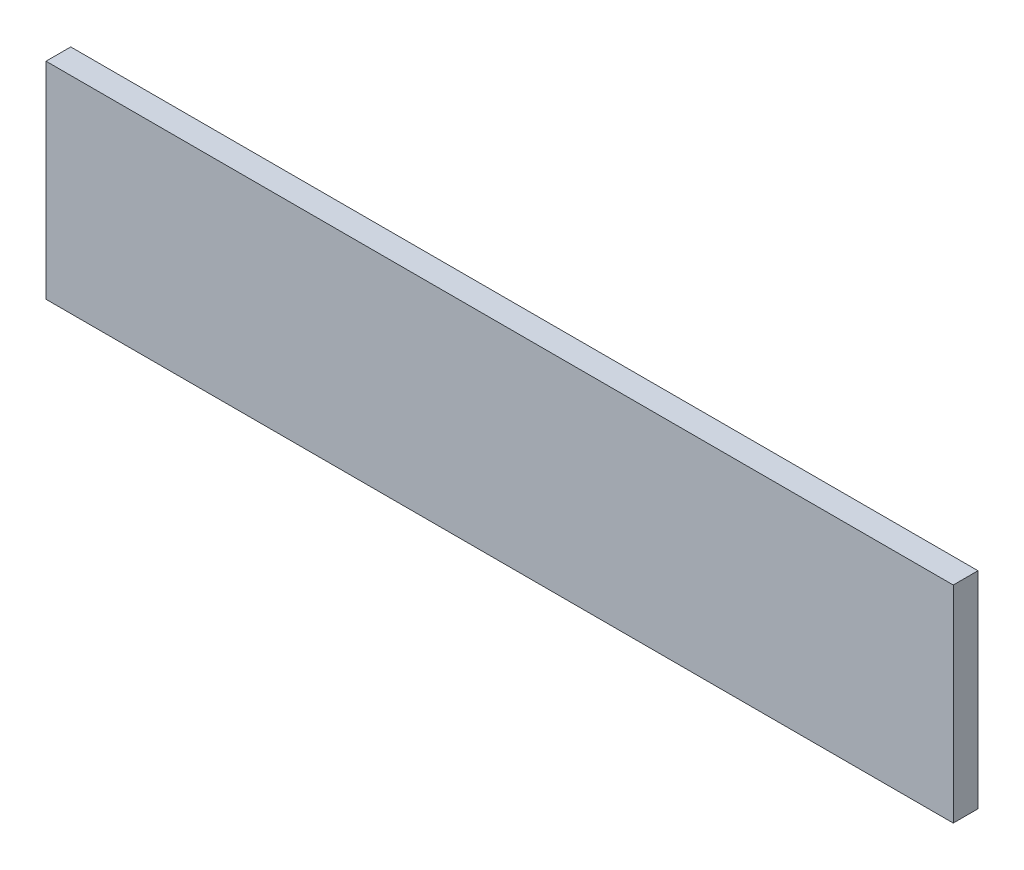
ISO-10303-21;
HEADER;
FILE_DESCRIPTION(('STEP AP214'),'2;1');
FILE_NAME('part.step','',(''),(''),'','','');
FILE_SCHEMA(('AUTOMOTIVE_DESIGN { 1 0 10303 214 1 1 1 1 }'));
ENDSEC;
DATA;
#1=APPLICATION_CONTEXT('core data for automotive mechanical design processes');
#2=APPLICATION_PROTOCOL_DEFINITION('international standard','automotive_design',2000,#1);
#3=PRODUCT_CONTEXT('',#1,'mechanical');
#4=PRODUCT('Part','Part','',(#3));
#5=PRODUCT_RELATED_PRODUCT_CATEGORY('part','',(#4));
#6=PRODUCT_DEFINITION_FORMATION('','',#4);
#7=PRODUCT_DEFINITION_CONTEXT('part definition',#1,'design');
#8=PRODUCT_DEFINITION('design','',#6,#7);
#9=PRODUCT_DEFINITION_SHAPE('','',#8);
#10=(LENGTH_UNIT() NAMED_UNIT(*) SI_UNIT(.MILLI.,.METRE.));
#11=(NAMED_UNIT(*) PLANE_ANGLE_UNIT() SI_UNIT($,.RADIAN.));
#12=(NAMED_UNIT(*) SI_UNIT($,.STERADIAN.) SOLID_ANGLE_UNIT());
#13=UNCERTAINTY_MEASURE_WITH_UNIT(LENGTH_MEASURE(1.E-05),#10,'distance_accuracy_value','');
#14=(GEOMETRIC_REPRESENTATION_CONTEXT(3) GLOBAL_UNCERTAINTY_ASSIGNED_CONTEXT((#13)) GLOBAL_UNIT_ASSIGNED_CONTEXT((#10,
#11,#12)) REPRESENTATION_CONTEXT('',''));
#15=CARTESIAN_POINT('',(0.,0.,0.));
#16=DIRECTION('',(0.,0.,1.));
#17=DIRECTION('',(1.,0.,0.));
#18=AXIS2_PLACEMENT_3D('',#15,#16,#17);
#19=CARTESIAN_POINT('',(0.,0.,0.));
#20=DIRECTION('',(0.,0.,1.));
#21=DIRECTION('',(1.,0.,0.));
#22=AXIS2_PLACEMENT_3D('',#19,#20,#21);
#23=PLANE('',#22);
#24=DIRECTION('',(0.,1.,0.));
#25=VECTOR('',#24,1.);
#26=CARTESIAN_POINT('',(550.,125.,0.));
#27=LINE('',#26,#25);
#28=CARTESIAN_POINT('',(550.,-125.,0.));
#29=VERTEX_POINT('',#28);
#30=CARTESIAN_POINT('',(550.,125.,0.));
#31=VERTEX_POINT('',#30);
#32=EDGE_CURVE('E20',#29,#31,#27,.T.);
#33=ORIENTED_EDGE('',*,*,#32,.F.);
#34=DIRECTION('',(1.,0.,0.));
#35=VECTOR('',#34,1.);
#36=CARTESIAN_POINT('',(550.,-125.,0.));
#37=LINE('',#36,#35);
#38=CARTESIAN_POINT('',(-550.,-125.,0.));
#39=VERTEX_POINT('',#38);
#40=EDGE_CURVE('E80',#39,#29,#37,.T.);
#41=ORIENTED_EDGE('',*,*,#40,.F.);
#42=DIRECTION('',(0.,1.,0.));
#43=VECTOR('',#42,1.);
#44=CARTESIAN_POINT('',(-550.,-125.,0.));
#45=LINE('',#44,#43);
#46=CARTESIAN_POINT('',(-550.,125.,0.));
#47=VERTEX_POINT('',#46);
#48=EDGE_CURVE('E68',#47,#39,#45,.F.);
#49=ORIENTED_EDGE('',*,*,#48,.F.);
#50=DIRECTION('',(1.,0.,0.));
#51=VECTOR('',#50,1.);
#52=CARTESIAN_POINT('',(-550.,125.,0.));
#53=LINE('',#52,#51);
#54=EDGE_CURVE('E55',#31,#47,#53,.F.);
#55=ORIENTED_EDGE('',*,*,#54,.F.);
#56=EDGE_LOOP('',(#33,#41,#49,#55));
#57=FACE_BOUND('',#56,.T.);
#58=ADVANCED_FACE('F17',(#57),#23,.F.);
#59=CARTESIAN_POINT('',(550.,125.,0.));
#60=DIRECTION('',(1.,0.,0.));
#61=DIRECTION('',(0.,0.,-1.));
#62=AXIS2_PLACEMENT_3D('',#59,#60,#61);
#63=PLANE('',#62);
#64=ORIENTED_EDGE('',*,*,#32,.T.);
#65=DIRECTION('',(0.,0.,1.));
#66=VECTOR('',#65,1.);
#67=CARTESIAN_POINT('',(550.,125.,0.));
#68=LINE('',#67,#66);
#69=CARTESIAN_POINT('',(550.,125.,30.));
#70=VERTEX_POINT('',#69);
#71=EDGE_CURVE('E61',#70,#31,#68,.F.);
#72=ORIENTED_EDGE('',*,*,#71,.F.);
#73=DIRECTION('',(0.,1.,0.));
#74=VECTOR('',#73,1.);
#75=CARTESIAN_POINT('',(550.,0.,30.));
#76=LINE('',#75,#74);
#77=CARTESIAN_POINT('',(550.,-125.,30.));
#78=VERTEX_POINT('',#77);
#79=EDGE_CURVE('E83',#78,#70,#76,.T.);
#80=ORIENTED_EDGE('',*,*,#79,.F.);
#81=DIRECTION('',(0.,0.,-1.));
#82=VECTOR('',#81,1.);
#83=CARTESIAN_POINT('',(550.,-125.,0.));
#84=LINE('',#83,#82);
#85=EDGE_CURVE('E64',#29,#78,#84,.F.);
#86=ORIENTED_EDGE('',*,*,#85,.F.);
#87=EDGE_LOOP('',(#64,#72,#80,#86));
#88=FACE_BOUND('',#87,.T.);
#89=ADVANCED_FACE('F60',(#88),#63,.T.);
#90=CARTESIAN_POINT('',(-550.,125.,0.));
#91=DIRECTION('',(0.,1.,0.));
#92=DIRECTION('',(0.,0.,1.));
#93=AXIS2_PLACEMENT_3D('',#90,#91,#92);
#94=PLANE('',#93);
#95=ORIENTED_EDGE('',*,*,#54,.T.);
#96=DIRECTION('',(0.,0.,1.));
#97=VECTOR('',#96,1.);
#98=CARTESIAN_POINT('',(-550.,125.,0.));
#99=LINE('',#98,#97);
#100=CARTESIAN_POINT('',(-550.,125.,30.));
#101=VERTEX_POINT('',#100);
#102=EDGE_CURVE('E70',#101,#47,#99,.F.);
#103=ORIENTED_EDGE('',*,*,#102,.F.);
#104=DIRECTION('',(1.,0.,0.));
#105=VECTOR('',#104,1.);
#106=CARTESIAN_POINT('',(0.,125.,30.));
#107=LINE('',#106,#105);
#108=EDGE_CURVE('E74',#70,#101,#107,.F.);
#109=ORIENTED_EDGE('',*,*,#108,.F.);
#110=ORIENTED_EDGE('',*,*,#71,.T.);
#111=EDGE_LOOP('',(#95,#103,#109,#110));
#112=FACE_BOUND('',#111,.T.);
#113=ADVANCED_FACE('F72',(#112),#94,.T.);
#114=CARTESIAN_POINT('',(-550.,-125.,0.));
#115=DIRECTION('',(-1.,0.,0.));
#116=DIRECTION('',(0.,0.,1.));
#117=AXIS2_PLACEMENT_3D('',#114,#115,#116);
#118=PLANE('',#117);
#119=ORIENTED_EDGE('',*,*,#48,.T.);
#120=DIRECTION('',(0.,0.,-1.));
#121=VECTOR('',#120,1.);
#122=CARTESIAN_POINT('',(-550.,-125.,0.));
#123=LINE('',#122,#121);
#124=CARTESIAN_POINT('',(-550.,-125.,30.));
#125=VERTEX_POINT('',#124);
#126=EDGE_CURVE('E35',#125,#39,#123,.T.);
#127=ORIENTED_EDGE('',*,*,#126,.F.);
#128=DIRECTION('',(0.,1.,0.));
#129=VECTOR('',#128,1.);
#130=CARTESIAN_POINT('',(-550.,0.,30.));
#131=LINE('',#130,#129);
#132=EDGE_CURVE('E26',#101,#125,#131,.F.);
#133=ORIENTED_EDGE('',*,*,#132,.F.);
#134=ORIENTED_EDGE('',*,*,#102,.T.);
#135=EDGE_LOOP('',(#119,#127,#133,#134));
#136=FACE_BOUND('',#135,.T.);
#137=ADVANCED_FACE('F89',(#136),#118,.T.);
#138=CARTESIAN_POINT('',(550.,-125.,0.));
#139=DIRECTION('',(0.,-1.,0.));
#140=DIRECTION('',(0.,0.,-1.));
#141=AXIS2_PLACEMENT_3D('',#138,#139,#140);
#142=PLANE('',#141);
#143=ORIENTED_EDGE('',*,*,#40,.T.);
#144=ORIENTED_EDGE('',*,*,#85,.T.);
#145=DIRECTION('',(1.,0.,0.));
#146=VECTOR('',#145,1.);
#147=CARTESIAN_POINT('',(0.,-125.,30.));
#148=LINE('',#147,#146);
#149=EDGE_CURVE('E11',#125,#78,#148,.T.);
#150=ORIENTED_EDGE('',*,*,#149,.F.);
#151=ORIENTED_EDGE('',*,*,#126,.T.);
#152=EDGE_LOOP('',(#143,#144,#150,#151));
#153=FACE_BOUND('',#152,.T.);
#154=ADVANCED_FACE('F91',(#153),#142,.T.);
#155=CARTESIAN_POINT('',(0.,0.,30.));
#156=DIRECTION('',(0.,0.,1.));
#157=DIRECTION('',(1.,0.,0.));
#158=AXIS2_PLACEMENT_3D('',#155,#156,#157);
#159=PLANE('',#158);
#160=ORIENTED_EDGE('',*,*,#132,.T.);
#161=ORIENTED_EDGE('',*,*,#149,.T.);
#162=ORIENTED_EDGE('',*,*,#79,.T.);
#163=ORIENTED_EDGE('',*,*,#108,.T.);
#164=EDGE_LOOP('',(#160,#161,#162,#163));
#165=FACE_BOUND('',#164,.T.);
#166=ADVANCED_FACE('F88',(#165),#159,.T.);
#167=CLOSED_SHELL('',(#58,#89,#113,#137,#154,#166));
#168=MANIFOLD_SOLID_BREP('B1',#167);
#169=ADVANCED_BREP_SHAPE_REPRESENTATION('',(#18,#168),#14);
#170=SHAPE_DEFINITION_REPRESENTATION(#9,#169);
ENDSEC;
END-ISO-10303-21;
